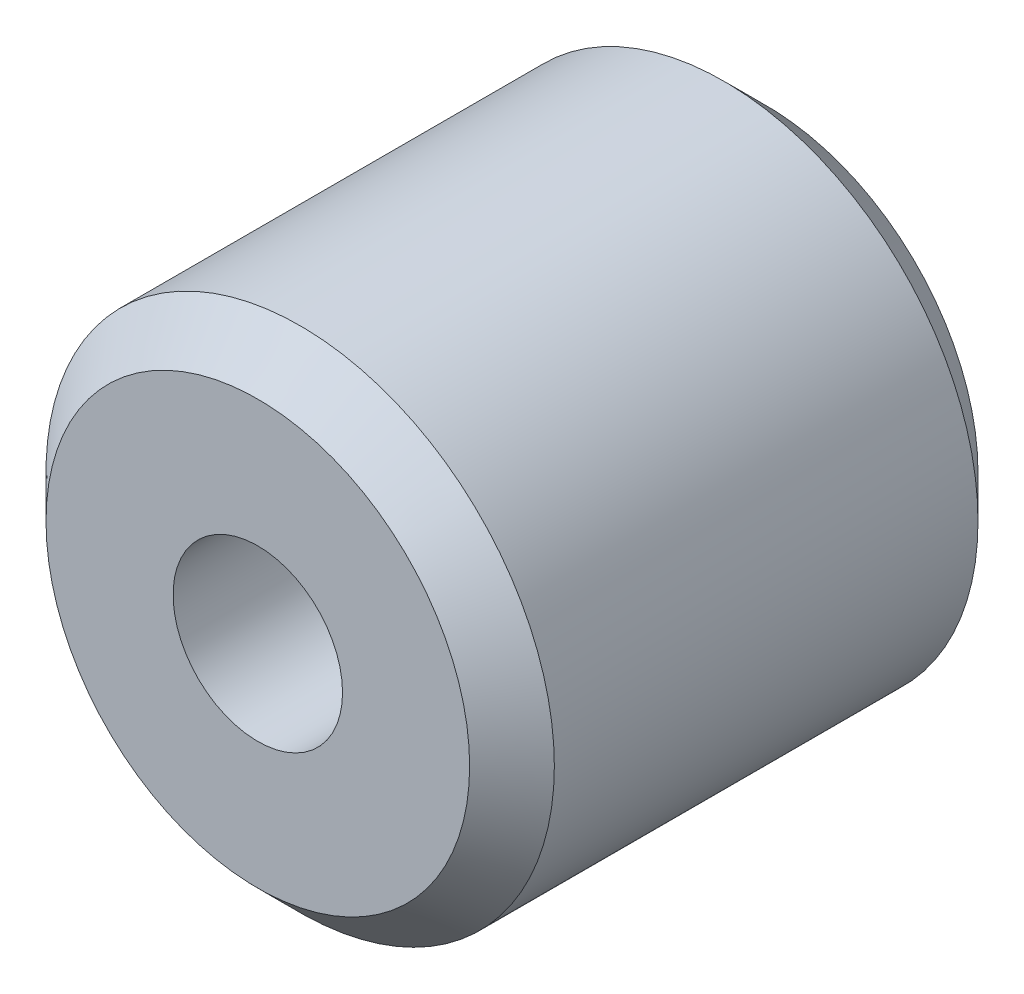
ISO-10303-21;
HEADER;
FILE_DESCRIPTION(('STEP AP214'),'2;1');
FILE_NAME('part.step','',(''),(''),'','','');
FILE_SCHEMA(('AUTOMOTIVE_DESIGN { 1 0 10303 214 1 1 1 1 }'));
ENDSEC;
DATA;
#1=APPLICATION_CONTEXT('core data for automotive mechanical design processes');
#2=APPLICATION_PROTOCOL_DEFINITION('international standard','automotive_design',2000,#1);
#3=PRODUCT_CONTEXT('',#1,'mechanical');
#4=PRODUCT('Part','Part','',(#3));
#5=PRODUCT_RELATED_PRODUCT_CATEGORY('part','',(#4));
#6=PRODUCT_DEFINITION_FORMATION('','',#4);
#7=PRODUCT_DEFINITION_CONTEXT('part definition',#1,'design');
#8=PRODUCT_DEFINITION('design','',#6,#7);
#9=PRODUCT_DEFINITION_SHAPE('','',#8);
#10=(LENGTH_UNIT() NAMED_UNIT(*) SI_UNIT(.MILLI.,.METRE.));
#11=(NAMED_UNIT(*) PLANE_ANGLE_UNIT() SI_UNIT($,.RADIAN.));
#12=(NAMED_UNIT(*) SI_UNIT($,.STERADIAN.) SOLID_ANGLE_UNIT());
#13=UNCERTAINTY_MEASURE_WITH_UNIT(LENGTH_MEASURE(1.E-05),#10,'distance_accuracy_value','');
#14=(GEOMETRIC_REPRESENTATION_CONTEXT(3) GLOBAL_UNCERTAINTY_ASSIGNED_CONTEXT((#13)) GLOBAL_UNIT_ASSIGNED_CONTEXT((#10,
#11,#12)) REPRESENTATION_CONTEXT('',''));
#15=CARTESIAN_POINT('',(0.,0.,0.));
#16=DIRECTION('',(0.,0.,1.));
#17=DIRECTION('',(1.,0.,0.));
#18=AXIS2_PLACEMENT_3D('',#15,#16,#17);
#19=CARTESIAN_POINT('',(0.,0.,12.));
#20=DIRECTION('',(0.,0.,1.));
#21=DIRECTION('',(1.,0.,0.));
#22=AXIS2_PLACEMENT_3D('',#19,#20,#21);
#23=PLANE('',#22);
#24=CARTESIAN_POINT('',(0.,0.,12.));
#25=DIRECTION('',(0.,0.,1.));
#26=DIRECTION('',(1.,0.,0.));
#27=AXIS2_PLACEMENT_3D('',#24,#25,#26);
#28=CIRCLE('',#27,5.);
#29=CARTESIAN_POINT('',(5.,0.,12.));
#30=VERTEX_POINT('',#29);
#31=EDGE_CURVE('E10',#30,#30,#28,.T.);
#32=ORIENTED_EDGE('',*,*,#31,.T.);
#33=EDGE_LOOP('',(#32));
#34=FACE_BOUND('',#33,.T.);
#35=CARTESIAN_POINT('',(0.,0.,12.));
#36=DIRECTION('',(0.,0.,1.));
#37=DIRECTION('',(1.,0.,0.));
#38=AXIS2_PLACEMENT_3D('',#35,#36,#37);
#39=CIRCLE('',#38,2.);
#40=CARTESIAN_POINT('',(2.,0.,12.));
#41=VERTEX_POINT('',#40);
#42=EDGE_CURVE('E53',#41,#41,#39,.T.);
#43=ORIENTED_EDGE('',*,*,#42,.F.);
#44=EDGE_LOOP('',(#43));
#45=FACE_BOUND('',#44,.T.);
#46=ADVANCED_FACE('F33',(#34,#45),#23,.T.);
#47=CARTESIAN_POINT('',(0.,0.,0.));
#48=DIRECTION('',(0.,0.,1.));
#49=DIRECTION('',(1.,0.,0.));
#50=AXIS2_PLACEMENT_3D('',#47,#48,#49);
#51=PLANE('',#50);
#52=CARTESIAN_POINT('',(0.,0.,0.));
#53=DIRECTION('',(0.,0.,1.));
#54=DIRECTION('',(1.,0.,0.));
#55=AXIS2_PLACEMENT_3D('',#52,#53,#54);
#56=CIRCLE('',#55,5.);
#57=CARTESIAN_POINT('',(5.,0.,0.));
#58=VERTEX_POINT('',#57);
#59=EDGE_CURVE('E40',#58,#58,#56,.F.);
#60=ORIENTED_EDGE('',*,*,#59,.T.);
#61=EDGE_LOOP('',(#60));
#62=FACE_BOUND('',#61,.T.);
#63=CARTESIAN_POINT('',(0.,0.,0.));
#64=DIRECTION('',(0.,0.,1.));
#65=DIRECTION('',(1.,0.,0.));
#66=AXIS2_PLACEMENT_3D('',#63,#64,#65);
#67=CIRCLE('',#66,2.);
#68=CARTESIAN_POINT('',(2.,0.,0.));
#69=VERTEX_POINT('',#68);
#70=EDGE_CURVE('E54',#69,#69,#67,.T.);
#71=ORIENTED_EDGE('',*,*,#70,.T.);
#72=EDGE_LOOP('',(#71));
#73=FACE_BOUND('',#72,.T.);
#74=ADVANCED_FACE('F64',(#62,#73),#51,.F.);
#75=CARTESIAN_POINT('',(0.,0.,12.));
#76=DIRECTION('',(0.,0.,-1.));
#77=DIRECTION('',(-1.,0.,0.));
#78=AXIS2_PLACEMENT_3D('',#75,#76,#77);
#79=CYLINDRICAL_SURFACE('',#78,6.);
#80=CARTESIAN_POINT('',(0.,0.,0.999999999999999));
#81=DIRECTION('',(0.,0.,1.));
#82=DIRECTION('',(1.,0.,0.));
#83=AXIS2_PLACEMENT_3D('',#80,#81,#82);
#84=CIRCLE('',#83,6.);
#85=CARTESIAN_POINT('',(6.,0.,0.999999999999999));
#86=VERTEX_POINT('',#85);
#87=EDGE_CURVE('E44',#86,#86,#84,.T.);
#88=ORIENTED_EDGE('',*,*,#87,.T.);
#89=EDGE_LOOP('',(#88));
#90=FACE_BOUND('',#89,.T.);
#91=CARTESIAN_POINT('',(0.,0.,11.));
#92=DIRECTION('',(0.,0.,1.));
#93=DIRECTION('',(1.,0.,0.));
#94=AXIS2_PLACEMENT_3D('',#91,#92,#93);
#95=CIRCLE('',#94,6.);
#96=CARTESIAN_POINT('',(6.,0.,11.));
#97=VERTEX_POINT('',#96);
#98=EDGE_CURVE('E48',#97,#97,#95,.F.);
#99=ORIENTED_EDGE('',*,*,#98,.T.);
#100=EDGE_LOOP('',(#99));
#101=FACE_BOUND('',#100,.T.);
#102=ADVANCED_FACE('F69',(#90,#101),#79,.T.);
#103=CARTESIAN_POINT('',(0.,0.,12.));
#104=DIRECTION('',(0.,0.,-1.));
#105=DIRECTION('',(-1.,0.,0.));
#106=AXIS2_PLACEMENT_3D('',#103,#104,#105);
#107=CYLINDRICAL_SURFACE('',#106,2.);
#108=ORIENTED_EDGE('',*,*,#42,.T.);
#109=EDGE_LOOP('',(#108));
#110=FACE_BOUND('',#109,.T.);
#111=ORIENTED_EDGE('',*,*,#70,.F.);
#112=EDGE_LOOP('',(#111));
#113=FACE_BOUND('',#112,.T.);
#114=ADVANCED_FACE('F60',(#110,#113),#107,.F.);
#115=CARTESIAN_POINT('',(0.,0.,0.999999999999999));
#116=DIRECTION('',(0.,0.,1.));
#117=DIRECTION('',(1.,0.,0.));
#118=AXIS2_PLACEMENT_3D('',#115,#116,#117);
#119=CONICAL_SURFACE('',#118,6.,0.785398163397449);
#120=ORIENTED_EDGE('',*,*,#59,.F.);
#121=EDGE_LOOP('',(#120));
#122=FACE_BOUND('',#121,.T.);
#123=ORIENTED_EDGE('',*,*,#87,.F.);
#124=EDGE_LOOP('',(#123));
#125=FACE_BOUND('',#124,.T.);
#126=ADVANCED_FACE('F75',(#122,#125),#119,.T.);
#127=CARTESIAN_POINT('',(0.,0.,12.));
#128=DIRECTION('',(0.,0.,-1.));
#129=DIRECTION('',(-1.,0.,0.));
#130=AXIS2_PLACEMENT_3D('',#127,#128,#129);
#131=CONICAL_SURFACE('',#130,5.,0.785398163397449);
#132=ORIENTED_EDGE('',*,*,#98,.F.);
#133=EDGE_LOOP('',(#132));
#134=FACE_BOUND('',#133,.T.);
#135=ORIENTED_EDGE('',*,*,#31,.F.);
#136=EDGE_LOOP('',(#135));
#137=FACE_BOUND('',#136,.T.);
#138=ADVANCED_FACE('F35',(#134,#137),#131,.T.);
#139=CLOSED_SHELL('',(#46,#74,#102,#114,#126,#138));
#140=MANIFOLD_SOLID_BREP('B2',#139);
#141=ADVANCED_BREP_SHAPE_REPRESENTATION('',(#18,#140),#14);
#142=SHAPE_DEFINITION_REPRESENTATION(#9,#141);
ENDSEC;
END-ISO-10303-21;
